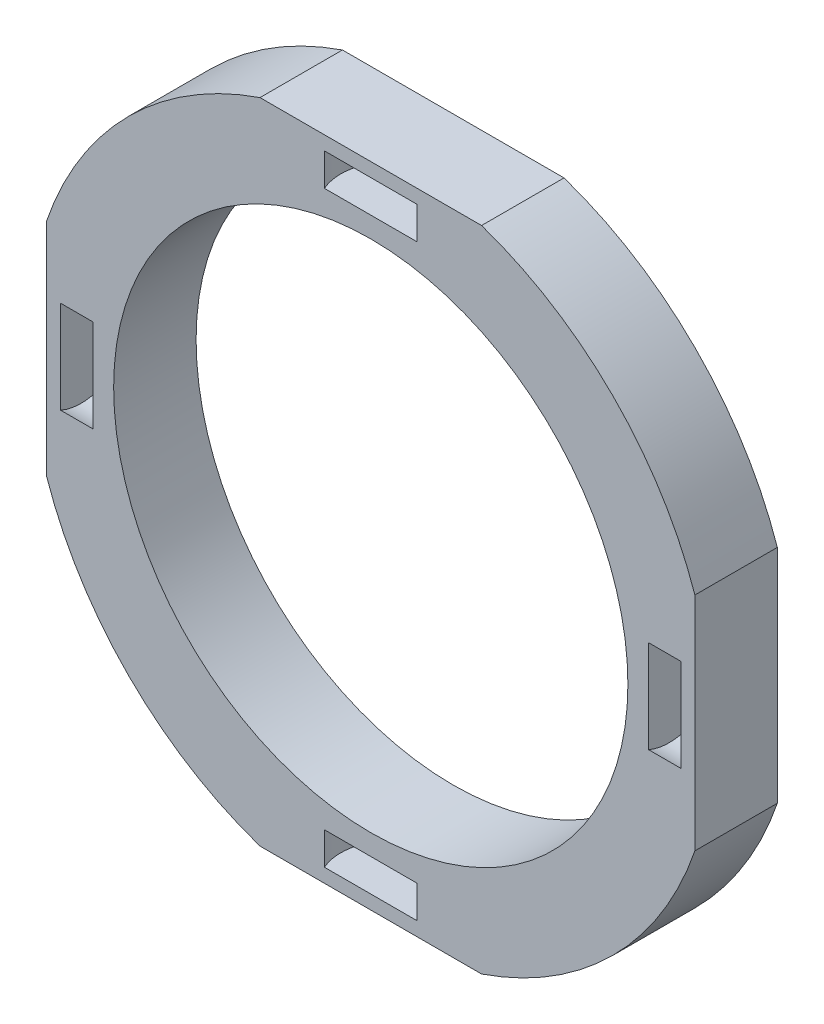
ISO-10303-21;
HEADER;
FILE_DESCRIPTION(('STEP AP214'),'2;1');
FILE_NAME('part.step','',(''),(''),'','','');
FILE_SCHEMA(('AUTOMOTIVE_DESIGN { 1 0 10303 214 1 1 1 1 }'));
ENDSEC;
DATA;
#1=APPLICATION_CONTEXT('core data for automotive mechanical design processes');
#2=APPLICATION_PROTOCOL_DEFINITION('international standard','automotive_design',2000,#1);
#3=PRODUCT_CONTEXT('',#1,'mechanical');
#4=PRODUCT('Part','Part','',(#3));
#5=PRODUCT_RELATED_PRODUCT_CATEGORY('part','',(#4));
#6=PRODUCT_DEFINITION_FORMATION('','',#4);
#7=PRODUCT_DEFINITION_CONTEXT('part definition',#1,'design');
#8=PRODUCT_DEFINITION('design','',#6,#7);
#9=PRODUCT_DEFINITION_SHAPE('','',#8);
#10=(LENGTH_UNIT() NAMED_UNIT(*) SI_UNIT(.MILLI.,.METRE.));
#11=(NAMED_UNIT(*) PLANE_ANGLE_UNIT() SI_UNIT($,.RADIAN.));
#12=(NAMED_UNIT(*) SI_UNIT($,.STERADIAN.) SOLID_ANGLE_UNIT());
#13=UNCERTAINTY_MEASURE_WITH_UNIT(LENGTH_MEASURE(1.E-05),#10,'distance_accuracy_value','');
#14=(GEOMETRIC_REPRESENTATION_CONTEXT(3) GLOBAL_UNCERTAINTY_ASSIGNED_CONTEXT((#13)) GLOBAL_UNIT_ASSIGNED_CONTEXT((#10,
#11,#12)) REPRESENTATION_CONTEXT('',''));
#15=CARTESIAN_POINT('',(0.,0.,0.));
#16=DIRECTION('',(0.,0.,1.));
#17=DIRECTION('',(1.,0.,0.));
#18=AXIS2_PLACEMENT_3D('',#15,#16,#17);
#19=CARTESIAN_POINT('',(0.,0.,1.016));
#20=DIRECTION('',(0.,0.,1.));
#21=DIRECTION('',(1.,0.,0.));
#22=AXIS2_PLACEMENT_3D('',#19,#20,#21);
#23=PLANE('',#22);
#24=DIRECTION('',(0.,1.,0.));
#25=VECTOR('',#24,1.);
#26=CARTESIAN_POINT('',(13.6906,0.,1.016));
#27=LINE('',#26,#25);
#28=CARTESIAN_POINT('',(13.6906,-2.284238114777,1.016));
#29=VERTEX_POINT('',#28);
#30=CARTESIAN_POINT('',(13.6906,2.284238114777,1.016));
#31=VERTEX_POINT('',#30);
#32=EDGE_CURVE('E164',#29,#31,#27,.T.);
#33=ORIENTED_EDGE('',*,*,#32,.T.);
#34=DIRECTION('',(-1.,0.,0.));
#35=VECTOR('',#34,1.);
#36=CARTESIAN_POINT('',(13.6906,2.284238114777,1.016));
#37=LINE('',#36,#35);
#38=CARTESIAN_POINT('',(15.2908,2.284238114777,1.016));
#39=VERTEX_POINT('',#38);
#40=EDGE_CURVE('E161',#31,#39,#37,.F.);
#41=ORIENTED_EDGE('',*,*,#40,.T.);
#42=DIRECTION('',(0.,-1.,0.));
#43=VECTOR('',#42,1.);
#44=CARTESIAN_POINT('',(15.2908,0.,1.016));
#45=LINE('',#44,#43);
#46=CARTESIAN_POINT('',(15.2908,-2.284238114777,1.016));
#47=VERTEX_POINT('',#46);
#48=EDGE_CURVE('E167',#39,#47,#45,.T.);
#49=ORIENTED_EDGE('',*,*,#48,.T.);
#50=DIRECTION('',(-1.,0.,0.));
#51=VECTOR('',#50,1.);
#52=CARTESIAN_POINT('',(13.6906,-2.284238114777,1.016));
#53=LINE('',#52,#51);
#54=EDGE_CURVE('E170',#47,#29,#53,.T.);
#55=ORIENTED_EDGE('',*,*,#54,.T.);
#56=EDGE_LOOP('',(#33,#41,#49,#55));
#57=FACE_BOUND('',#56,.T.);
#58=DIRECTION('',(0.,-1.,0.));
#59=VECTOR('',#58,1.);
#60=CARTESIAN_POINT('',(-13.6906,0.,1.016));
#61=LINE('',#60,#59);
#62=CARTESIAN_POINT('',(-13.6906,2.284238114777,1.016));
#63=VERTEX_POINT('',#62);
#64=CARTESIAN_POINT('',(-13.6906,-2.284238114777,1.016));
#65=VERTEX_POINT('',#64);
#66=EDGE_CURVE('E188',#63,#65,#61,.T.);
#67=ORIENTED_EDGE('',*,*,#66,.T.);
#68=DIRECTION('',(1.,0.,0.));
#69=VECTOR('',#68,1.);
#70=CARTESIAN_POINT('',(-13.6906,-2.284238114777,1.016));
#71=LINE('',#70,#69);
#72=CARTESIAN_POINT('',(-15.2908,-2.284238114777,1.016));
#73=VERTEX_POINT('',#72);
#74=EDGE_CURVE('E185',#65,#73,#71,.F.);
#75=ORIENTED_EDGE('',*,*,#74,.T.);
#76=DIRECTION('',(0.,1.,0.));
#77=VECTOR('',#76,1.);
#78=CARTESIAN_POINT('',(-15.2908,0.,1.016));
#79=LINE('',#78,#77);
#80=CARTESIAN_POINT('',(-15.2908,2.284238114777,1.016));
#81=VERTEX_POINT('',#80);
#82=EDGE_CURVE('E191',#73,#81,#79,.T.);
#83=ORIENTED_EDGE('',*,*,#82,.T.);
#84=DIRECTION('',(1.,0.,0.));
#85=VECTOR('',#84,1.);
#86=CARTESIAN_POINT('',(-13.6906,2.284238114777,1.016));
#87=LINE('',#86,#85);
#88=EDGE_CURVE('E194',#81,#63,#87,.T.);
#89=ORIENTED_EDGE('',*,*,#88,.T.);
#90=EDGE_LOOP('',(#67,#75,#83,#89));
#91=FACE_BOUND('',#90,.T.);
#92=CARTESIAN_POINT('',(0.,0.,1.016));
#93=DIRECTION('',(0.,0.,1.));
#94=DIRECTION('',(1.,0.,0.));
#95=AXIS2_PLACEMENT_3D('',#92,#93,#94);
#96=CIRCLE('',#95,12.6746);
#97=CARTESIAN_POINT('',(12.6746,0.,1.016));
#98=VERTEX_POINT('',#97);
#99=EDGE_CURVE('E252',#98,#98,#96,.T.);
#100=ORIENTED_EDGE('',*,*,#99,.F.);
#101=EDGE_LOOP('',(#100));
#102=FACE_BOUND('',#101,.T.);
#103=DIRECTION('',(0.,1.,0.));
#104=VECTOR('',#103,1.);
#105=CARTESIAN_POINT('',(15.9766,0.,1.016));
#106=LINE('',#105,#104);
#107=CARTESIAN_POINT('',(15.9766,-5.46108821676877,1.016));
#108=VERTEX_POINT('',#107);
#109=CARTESIAN_POINT('',(15.9766,5.46108821676877,1.016));
#110=VERTEX_POINT('',#109);
#111=EDGE_CURVE('E249',#108,#110,#106,.T.);
#112=ORIENTED_EDGE('',*,*,#111,.T.);
#113=CARTESIAN_POINT('',(0.,0.,1.016));
#114=DIRECTION('',(0.,0.,1.));
#115=DIRECTION('',(1.,0.,0.));
#116=AXIS2_PLACEMENT_3D('',#113,#114,#115);
#117=CIRCLE('',#116,16.8841710507603);
#118=CARTESIAN_POINT('',(5.46108821676877,15.9766,1.016));
#119=VERTEX_POINT('',#118);
#120=EDGE_CURVE('E246',#110,#119,#117,.T.);
#121=ORIENTED_EDGE('',*,*,#120,.T.);
#122=DIRECTION('',(-1.,0.,0.));
#123=VECTOR('',#122,1.);
#124=CARTESIAN_POINT('',(0.,15.9766,1.016));
#125=LINE('',#124,#123);
#126=CARTESIAN_POINT('',(-5.46108821676877,15.9766,1.016));
#127=VERTEX_POINT('',#126);
#128=EDGE_CURVE('E243',#119,#127,#125,.T.);
#129=ORIENTED_EDGE('',*,*,#128,.T.);
#130=CARTESIAN_POINT('',(-15.9766,5.46108821676877,1.016));
#131=VERTEX_POINT('',#130);
#132=EDGE_CURVE('E242',#127,#131,#117,.T.);
#133=ORIENTED_EDGE('',*,*,#132,.T.);
#134=DIRECTION('',(0.,-1.,0.));
#135=VECTOR('',#134,1.);
#136=CARTESIAN_POINT('',(-15.9766,0.,1.016));
#137=LINE('',#136,#135);
#138=CARTESIAN_POINT('',(-15.9766,-5.46108821676877,1.016));
#139=VERTEX_POINT('',#138);
#140=EDGE_CURVE('E239',#131,#139,#137,.T.);
#141=ORIENTED_EDGE('',*,*,#140,.T.);
#142=CARTESIAN_POINT('',(-5.46108821676877,-15.9766,1.016));
#143=VERTEX_POINT('',#142);
#144=EDGE_CURVE('E238',#139,#143,#117,.T.);
#145=ORIENTED_EDGE('',*,*,#144,.T.);
#146=DIRECTION('',(1.,0.,0.));
#147=VECTOR('',#146,1.);
#148=CARTESIAN_POINT('',(0.,-15.9766,1.016));
#149=LINE('',#148,#147);
#150=CARTESIAN_POINT('',(5.46108821676877,-15.9766,1.016));
#151=VERTEX_POINT('',#150);
#152=EDGE_CURVE('E235',#143,#151,#149,.T.);
#153=ORIENTED_EDGE('',*,*,#152,.T.);
#154=EDGE_CURVE('E234',#151,#108,#117,.T.);
#155=ORIENTED_EDGE('',*,*,#154,.T.);
#156=EDGE_LOOP('',(#112,#121,#129,#133,#141,#145,#153,#155));
#157=FACE_BOUND('',#156,.T.);
#158=DIRECTION('',(1.,0.,0.));
#159=VECTOR('',#158,1.);
#160=CARTESIAN_POINT('',(0.,-13.6906,1.016));
#161=LINE('',#160,#159);
#162=CARTESIAN_POINT('',(-2.28423811477695,-13.6906,1.016));
#163=VERTEX_POINT('',#162);
#164=CARTESIAN_POINT('',(2.28423811477705,-13.6906,1.016));
#165=VERTEX_POINT('',#164);
#166=EDGE_CURVE('E176',#163,#165,#161,.T.);
#167=ORIENTED_EDGE('',*,*,#166,.T.);
#168=DIRECTION('',(0.,1.,0.));
#169=VECTOR('',#168,1.);
#170=CARTESIAN_POINT('',(2.28423811477705,-13.6906,1.016));
#171=LINE('',#170,#169);
#172=CARTESIAN_POINT('',(2.28423811477706,-15.2908,1.016));
#173=VERTEX_POINT('',#172);
#174=EDGE_CURVE('E173',#165,#173,#171,.F.);
#175=ORIENTED_EDGE('',*,*,#174,.T.);
#176=DIRECTION('',(-1.,0.,0.));
#177=VECTOR('',#176,1.);
#178=CARTESIAN_POINT('',(0.,-15.2908,1.016));
#179=LINE('',#178,#177);
#180=CARTESIAN_POINT('',(-2.28423811477695,-15.2908,1.016));
#181=VERTEX_POINT('',#180);
#182=EDGE_CURVE('E179',#173,#181,#179,.T.);
#183=ORIENTED_EDGE('',*,*,#182,.T.);
#184=DIRECTION('',(0.,1.,0.));
#185=VECTOR('',#184,1.);
#186=CARTESIAN_POINT('',(-2.28423811477695,-13.6906,1.016));
#187=LINE('',#186,#185);
#188=EDGE_CURVE('E182',#181,#163,#187,.T.);
#189=ORIENTED_EDGE('',*,*,#188,.T.);
#190=EDGE_LOOP('',(#167,#175,#183,#189));
#191=FACE_BOUND('',#190,.T.);
#192=DIRECTION('',(-1.,0.,0.));
#193=VECTOR('',#192,1.);
#194=CARTESIAN_POINT('',(-1.45078038199538E-13,13.6906,1.016));
#195=LINE('',#194,#193);
#196=CARTESIAN_POINT('',(2.28423811477686,13.6906,1.016));
#197=VERTEX_POINT('',#196);
#198=CARTESIAN_POINT('',(-2.28423811477715,13.6906,1.016));
#199=VERTEX_POINT('',#198);
#200=EDGE_CURVE('E43',#197,#199,#195,.T.);
#201=ORIENTED_EDGE('',*,*,#200,.T.);
#202=DIRECTION('',(0.,-1.,0.));
#203=VECTOR('',#202,1.);
#204=CARTESIAN_POINT('',(-2.28423811477714,13.6906,1.016));
#205=LINE('',#204,#203);
#206=CARTESIAN_POINT('',(-2.28423811477716,15.2908,1.016));
#207=VERTEX_POINT('',#206);
#208=EDGE_CURVE('E11',#199,#207,#205,.F.);
#209=ORIENTED_EDGE('',*,*,#208,.T.);
#210=DIRECTION('',(1.,0.,0.));
#211=VECTOR('',#210,1.);
#212=CARTESIAN_POINT('',(-1.62035211495588E-13,15.2908,1.016));
#213=LINE('',#212,#211);
#214=CARTESIAN_POINT('',(2.28423811477684,15.2908,1.016));
#215=VERTEX_POINT('',#214);
#216=EDGE_CURVE('E157',#207,#215,#213,.T.);
#217=ORIENTED_EDGE('',*,*,#216,.T.);
#218=DIRECTION('',(0.,-1.,0.));
#219=VECTOR('',#218,1.);
#220=CARTESIAN_POINT('',(2.28423811477686,13.6906,1.016));
#221=LINE('',#220,#219);
#222=EDGE_CURVE('E156',#215,#197,#221,.T.);
#223=ORIENTED_EDGE('',*,*,#222,.T.);
#224=EDGE_LOOP('',(#201,#209,#217,#223));
#225=FACE_BOUND('',#224,.T.);
#226=ADVANCED_FACE('F35',(#57,#91,#102,#157,#191,#225),#23,.T.);
#227=CARTESIAN_POINT('',(15.9766,0.,-3.048));
#228=DIRECTION('',(1.,0.,0.));
#229=DIRECTION('',(0.,0.,-1.));
#230=AXIS2_PLACEMENT_3D('',#227,#228,#229);
#231=PLANE('',#230);
#232=DIRECTION('',(0.,0.,1.));
#233=VECTOR('',#232,1.);
#234=CARTESIAN_POINT('',(15.9766,5.46108821676877,-3.048));
#235=LINE('',#234,#233);
#236=CARTESIAN_POINT('',(15.9766,5.46108821676877,-3.048));
#237=VERTEX_POINT('',#236);
#238=EDGE_CURVE('E198',#237,#110,#235,.T.);
#239=ORIENTED_EDGE('',*,*,#238,.T.);
#240=ORIENTED_EDGE('',*,*,#111,.F.);
#241=DIRECTION('',(0.,0.,1.));
#242=VECTOR('',#241,1.);
#243=CARTESIAN_POINT('',(15.9766,-5.46108821676877,-3.048));
#244=LINE('',#243,#242);
#245=CARTESIAN_POINT('',(15.9766,-5.46108821676877,-3.048));
#246=VERTEX_POINT('',#245);
#247=EDGE_CURVE('E197',#246,#108,#244,.T.);
#248=ORIENTED_EDGE('',*,*,#247,.F.);
#249=DIRECTION('',(0.,1.,0.));
#250=VECTOR('',#249,1.);
#251=CARTESIAN_POINT('',(15.9766,0.,-3.048));
#252=LINE('',#251,#250);
#253=EDGE_CURVE('E228',#246,#237,#252,.T.);
#254=ORIENTED_EDGE('',*,*,#253,.T.);
#255=EDGE_LOOP('',(#239,#240,#248,#254));
#256=FACE_BOUND('',#255,.T.);
#257=ADVANCED_FACE('F281',(#256),#231,.T.);
#258=CARTESIAN_POINT('',(0.,0.,-3.048));
#259=DIRECTION('',(0.,0.,1.));
#260=DIRECTION('',(1.,0.,0.));
#261=AXIS2_PLACEMENT_3D('',#258,#259,#260);
#262=CYLINDRICAL_SURFACE('',#261,16.8841710507603);
#263=ORIENTED_EDGE('',*,*,#247,.T.);
#264=ORIENTED_EDGE('',*,*,#154,.F.);
#265=DIRECTION('',(0.,0.,1.));
#266=VECTOR('',#265,1.);
#267=CARTESIAN_POINT('',(5.46108821676877,-15.9766,-3.048));
#268=LINE('',#267,#266);
#269=CARTESIAN_POINT('',(5.46108821676877,-15.9766,-3.048));
#270=VERTEX_POINT('',#269);
#271=EDGE_CURVE('E211',#270,#151,#268,.T.);
#272=ORIENTED_EDGE('',*,*,#271,.F.);
#273=CARTESIAN_POINT('',(0.,0.,-3.048));
#274=DIRECTION('',(0.,0.,1.));
#275=DIRECTION('',(1.,0.,0.));
#276=AXIS2_PLACEMENT_3D('',#273,#274,#275);
#277=CIRCLE('',#276,16.8841710507603);
#278=EDGE_CURVE('E201',#270,#246,#277,.T.);
#279=ORIENTED_EDGE('',*,*,#278,.T.);
#280=EDGE_LOOP('',(#263,#264,#272,#279));
#281=FACE_BOUND('',#280,.T.);
#282=ADVANCED_FACE('F287',(#281),#262,.T.);
#283=CARTESIAN_POINT('',(0.,-15.9766,-3.048));
#284=DIRECTION('',(0.,-1.,0.));
#285=DIRECTION('',(0.,0.,-1.));
#286=AXIS2_PLACEMENT_3D('',#283,#284,#285);
#287=PLANE('',#286);
#288=ORIENTED_EDGE('',*,*,#271,.T.);
#289=ORIENTED_EDGE('',*,*,#152,.F.);
#290=DIRECTION('',(0.,0.,1.));
#291=VECTOR('',#290,1.);
#292=CARTESIAN_POINT('',(-5.46108821676877,-15.9766,-3.048));
#293=LINE('',#292,#291);
#294=CARTESIAN_POINT('',(-5.46108821676877,-15.9766,-3.048));
#295=VERTEX_POINT('',#294);
#296=EDGE_CURVE('E209',#295,#143,#293,.T.);
#297=ORIENTED_EDGE('',*,*,#296,.F.);
#298=DIRECTION('',(1.,0.,0.));
#299=VECTOR('',#298,1.);
#300=CARTESIAN_POINT('',(0.,-15.9766,-3.048));
#301=LINE('',#300,#299);
#302=EDGE_CURVE('E214',#295,#270,#301,.T.);
#303=ORIENTED_EDGE('',*,*,#302,.T.);
#304=EDGE_LOOP('',(#288,#289,#297,#303));
#305=FACE_BOUND('',#304,.T.);
#306=ADVANCED_FACE('F301',(#305),#287,.T.);
#307=ORIENTED_EDGE('',*,*,#296,.T.);
#308=ORIENTED_EDGE('',*,*,#144,.F.);
#309=DIRECTION('',(0.,0.,1.));
#310=VECTOR('',#309,1.);
#311=CARTESIAN_POINT('',(-15.9766,-5.46108821676877,-3.048));
#312=LINE('',#311,#310);
#313=CARTESIAN_POINT('',(-15.9766,-5.46108821676877,-3.048));
#314=VERTEX_POINT('',#313);
#315=EDGE_CURVE('E207',#314,#139,#312,.T.);
#316=ORIENTED_EDGE('',*,*,#315,.F.);
#317=EDGE_CURVE('E217',#314,#295,#277,.T.);
#318=ORIENTED_EDGE('',*,*,#317,.T.);
#319=EDGE_LOOP('',(#307,#308,#316,#318));
#320=FACE_BOUND('',#319,.T.);
#321=ADVANCED_FACE('F303',(#320),#262,.T.);
#322=CARTESIAN_POINT('',(-15.9766,0.,-3.048));
#323=DIRECTION('',(-1.,0.,0.));
#324=DIRECTION('',(0.,0.,1.));
#325=AXIS2_PLACEMENT_3D('',#322,#323,#324);
#326=PLANE('',#325);
#327=ORIENTED_EDGE('',*,*,#315,.T.);
#328=ORIENTED_EDGE('',*,*,#140,.F.);
#329=DIRECTION('',(0.,0.,1.));
#330=VECTOR('',#329,1.);
#331=CARTESIAN_POINT('',(-15.9766,5.46108821676877,-3.048));
#332=LINE('',#331,#330);
#333=CARTESIAN_POINT('',(-15.9766,5.46108821676877,-3.048));
#334=VERTEX_POINT('',#333);
#335=EDGE_CURVE('E205',#334,#131,#332,.T.);
#336=ORIENTED_EDGE('',*,*,#335,.F.);
#337=DIRECTION('',(0.,-1.,0.));
#338=VECTOR('',#337,1.);
#339=CARTESIAN_POINT('',(-15.9766,0.,-3.048));
#340=LINE('',#339,#338);
#341=EDGE_CURVE('E218',#334,#314,#340,.T.);
#342=ORIENTED_EDGE('',*,*,#341,.T.);
#343=EDGE_LOOP('',(#327,#328,#336,#342));
#344=FACE_BOUND('',#343,.T.);
#345=ADVANCED_FACE('F307',(#344),#326,.T.);
#346=ORIENTED_EDGE('',*,*,#335,.T.);
#347=ORIENTED_EDGE('',*,*,#132,.F.);
#348=DIRECTION('',(0.,0.,1.));
#349=VECTOR('',#348,1.);
#350=CARTESIAN_POINT('',(-5.46108821676877,15.9766,-3.048));
#351=LINE('',#350,#349);
#352=CARTESIAN_POINT('',(-5.46108821676877,15.9766,-3.048));
#353=VERTEX_POINT('',#352);
#354=EDGE_CURVE('E203',#353,#127,#351,.T.);
#355=ORIENTED_EDGE('',*,*,#354,.F.);
#356=EDGE_CURVE('E221',#353,#334,#277,.T.);
#357=ORIENTED_EDGE('',*,*,#356,.T.);
#358=EDGE_LOOP('',(#346,#347,#355,#357));
#359=FACE_BOUND('',#358,.T.);
#360=ADVANCED_FACE('F310',(#359),#262,.T.);
#361=CARTESIAN_POINT('',(0.,15.9766,-3.048));
#362=DIRECTION('',(0.,1.,0.));
#363=DIRECTION('',(0.,0.,1.));
#364=AXIS2_PLACEMENT_3D('',#361,#362,#363);
#365=PLANE('',#364);
#366=ORIENTED_EDGE('',*,*,#354,.T.);
#367=ORIENTED_EDGE('',*,*,#128,.F.);
#368=DIRECTION('',(0.,0.,1.));
#369=VECTOR('',#368,1.);
#370=CARTESIAN_POINT('',(5.46108821676877,15.9766,-3.048));
#371=LINE('',#370,#369);
#372=CARTESIAN_POINT('',(5.46108821676877,15.9766,-3.048));
#373=VERTEX_POINT('',#372);
#374=EDGE_CURVE('E200',#373,#119,#371,.T.);
#375=ORIENTED_EDGE('',*,*,#374,.F.);
#376=DIRECTION('',(-1.,0.,0.));
#377=VECTOR('',#376,1.);
#378=CARTESIAN_POINT('',(0.,15.9766,-3.048));
#379=LINE('',#378,#377);
#380=EDGE_CURVE('E222',#373,#353,#379,.T.);
#381=ORIENTED_EDGE('',*,*,#380,.T.);
#382=EDGE_LOOP('',(#366,#367,#375,#381));
#383=FACE_BOUND('',#382,.T.);
#384=ADVANCED_FACE('F312',(#383),#365,.T.);
#385=CARTESIAN_POINT('',(0.,0.,-3.048));
#386=DIRECTION('',(0.,0.,1.));
#387=DIRECTION('',(1.,0.,0.));
#388=AXIS2_PLACEMENT_3D('',#385,#386,#387);
#389=CYLINDRICAL_SURFACE('',#388,12.6746);
#390=CARTESIAN_POINT('',(0.,0.,-3.048));
#391=DIRECTION('',(0.,0.,1.));
#392=DIRECTION('',(1.,0.,0.));
#393=AXIS2_PLACEMENT_3D('',#390,#391,#392);
#394=CIRCLE('',#393,12.6746);
#395=CARTESIAN_POINT('',(12.6746,0.,-3.048));
#396=VERTEX_POINT('',#395);
#397=EDGE_CURVE('E231',#396,#396,#394,.T.);
#398=ORIENTED_EDGE('',*,*,#397,.F.);
#399=EDGE_LOOP('',(#398));
#400=FACE_BOUND('',#399,.T.);
#401=ORIENTED_EDGE('',*,*,#99,.T.);
#402=EDGE_LOOP('',(#401));
#403=FACE_BOUND('',#402,.T.);
#404=ADVANCED_FACE('F37',(#400,#403),#389,.F.);
#405=ORIENTED_EDGE('',*,*,#374,.T.);
#406=ORIENTED_EDGE('',*,*,#120,.F.);
#407=ORIENTED_EDGE('',*,*,#238,.F.);
#408=EDGE_CURVE('E225',#237,#373,#277,.T.);
#409=ORIENTED_EDGE('',*,*,#408,.T.);
#410=EDGE_LOOP('',(#405,#406,#407,#409));
#411=FACE_BOUND('',#410,.T.);
#412=ADVANCED_FACE('F297',(#411),#262,.T.);
#413=CARTESIAN_POINT('',(0.,0.,-3.048));
#414=DIRECTION('',(0.,0.,1.));
#415=DIRECTION('',(1.,0.,0.));
#416=AXIS2_PLACEMENT_3D('',#413,#414,#415);
#417=PLANE('',#416);
#418=ORIENTED_EDGE('',*,*,#397,.T.);
#419=EDGE_LOOP('',(#418));
#420=FACE_BOUND('',#419,.T.);
#421=ORIENTED_EDGE('',*,*,#253,.F.);
#422=ORIENTED_EDGE('',*,*,#278,.F.);
#423=ORIENTED_EDGE('',*,*,#302,.F.);
#424=ORIENTED_EDGE('',*,*,#317,.F.);
#425=ORIENTED_EDGE('',*,*,#341,.F.);
#426=ORIENTED_EDGE('',*,*,#356,.F.);
#427=ORIENTED_EDGE('',*,*,#380,.F.);
#428=ORIENTED_EDGE('',*,*,#408,.F.);
#429=EDGE_LOOP('',(#421,#422,#423,#424,#425,#426,#427,#428));
#430=FACE_BOUND('',#429,.T.);
#431=ADVANCED_FACE('F294',(#420,#430),#417,.F.);
#432=CARTESIAN_POINT('',(-13.6906,-2.499999953,0.));
#433=DIRECTION('',(-1.,0.,0.));
#434=DIRECTION('',(0.,-1.,0.));
#435=AXIS2_PLACEMENT_3D('',#432,#433,#434);
#436=PLANE('',#435);
#437=CARTESIAN_POINT('',(-13.6906,0.,0.));
#438=DIRECTION('',(1.,0.,0.));
#439=DIRECTION('',(0.,1.,0.));
#440=AXIS2_PLACEMENT_3D('',#437,#438,#439);
#441=CIRCLE('',#440,2.499999953);
#442=EDGE_CURVE('E258',#65,#63,#441,.T.);
#443=ORIENTED_EDGE('',*,*,#442,.F.);
#444=ORIENTED_EDGE('',*,*,#66,.F.);
#445=EDGE_LOOP('',(#443,#444));
#446=FACE_BOUND('',#445,.T.);
#447=ADVANCED_FACE('F292',(#446),#436,.T.);
#448=CARTESIAN_POINT('',(-15.2908,-2.499999953,0.));
#449=DIRECTION('',(1.,0.,0.));
#450=DIRECTION('',(0.,1.,0.));
#451=AXIS2_PLACEMENT_3D('',#448,#449,#450);
#452=PLANE('',#451);
#453=CARTESIAN_POINT('',(-15.2908,0.,0.));
#454=DIRECTION('',(1.,0.,0.));
#455=DIRECTION('',(0.,1.,0.));
#456=AXIS2_PLACEMENT_3D('',#453,#454,#455);
#457=CIRCLE('',#456,2.499999953);
#458=EDGE_CURVE('E255',#73,#81,#457,.T.);
#459=ORIENTED_EDGE('',*,*,#458,.T.);
#460=ORIENTED_EDGE('',*,*,#82,.F.);
#461=EDGE_LOOP('',(#459,#460));
#462=FACE_BOUND('',#461,.T.);
#463=ADVANCED_FACE('F393',(#462),#452,.T.);
#464=CARTESIAN_POINT('',(-13.6906,0.,0.));
#465=DIRECTION('',(1.,0.,0.));
#466=DIRECTION('',(0.,1.,0.));
#467=AXIS2_PLACEMENT_3D('',#464,#465,#466);
#468=CYLINDRICAL_SURFACE('',#467,2.499999953);
#469=ORIENTED_EDGE('',*,*,#442,.T.);
#470=ORIENTED_EDGE('',*,*,#88,.F.);
#471=ORIENTED_EDGE('',*,*,#458,.F.);
#472=ORIENTED_EDGE('',*,*,#74,.F.);
#473=EDGE_LOOP('',(#469,#470,#471,#472));
#474=FACE_BOUND('',#473,.T.);
#475=ADVANCED_FACE('F402',(#474),#468,.F.);
#476=CARTESIAN_POINT('',(2.49999995300005,-13.6906,0.));
#477=DIRECTION('',(0.,-1.,0.));
#478=DIRECTION('',(1.,0.,0.));
#479=AXIS2_PLACEMENT_3D('',#476,#477,#478);
#480=PLANE('',#479);
#481=CARTESIAN_POINT('',(0.,-13.6906,0.));
#482=DIRECTION('',(0.,1.,0.));
#483=DIRECTION('',(-1.,0.,0.));
#484=AXIS2_PLACEMENT_3D('',#481,#482,#483);
#485=CIRCLE('',#484,2.499999953);
#486=EDGE_CURVE('E263',#165,#163,#485,.T.);
#487=ORIENTED_EDGE('',*,*,#486,.F.);
#488=ORIENTED_EDGE('',*,*,#166,.F.);
#489=EDGE_LOOP('',(#487,#488));
#490=FACE_BOUND('',#489,.T.);
#491=ADVANCED_FACE('F410',(#490),#480,.T.);
#492=CARTESIAN_POINT('',(2.49999995300005,-15.2908,0.));
#493=DIRECTION('',(0.,1.,0.));
#494=DIRECTION('',(-1.,0.,0.));
#495=AXIS2_PLACEMENT_3D('',#492,#493,#494);
#496=PLANE('',#495);
#497=CARTESIAN_POINT('',(0.,-15.2908,0.));
#498=DIRECTION('',(0.,1.,0.));
#499=DIRECTION('',(-1.,0.,0.));
#500=AXIS2_PLACEMENT_3D('',#497,#498,#499);
#501=CIRCLE('',#500,2.499999953);
#502=EDGE_CURVE('E260',#173,#181,#501,.T.);
#503=ORIENTED_EDGE('',*,*,#502,.T.);
#504=ORIENTED_EDGE('',*,*,#182,.F.);
#505=EDGE_LOOP('',(#503,#504));
#506=FACE_BOUND('',#505,.T.);
#507=ADVANCED_FACE('F425',(#506),#496,.T.);
#508=CARTESIAN_POINT('',(0.,-13.6906,0.));
#509=DIRECTION('',(0.,1.,0.));
#510=DIRECTION('',(-1.,0.,0.));
#511=AXIS2_PLACEMENT_3D('',#508,#509,#510);
#512=CYLINDRICAL_SURFACE('',#511,2.499999953);
#513=ORIENTED_EDGE('',*,*,#486,.T.);
#514=ORIENTED_EDGE('',*,*,#188,.F.);
#515=ORIENTED_EDGE('',*,*,#502,.F.);
#516=ORIENTED_EDGE('',*,*,#174,.F.);
#517=EDGE_LOOP('',(#513,#514,#515,#516));
#518=FACE_BOUND('',#517,.T.);
#519=ADVANCED_FACE('F435',(#518),#512,.F.);
#520=CARTESIAN_POINT('',(13.6906,2.499999953,0.));
#521=DIRECTION('',(1.,0.,0.));
#522=DIRECTION('',(0.,1.,0.));
#523=AXIS2_PLACEMENT_3D('',#520,#521,#522);
#524=PLANE('',#523);
#525=CARTESIAN_POINT('',(13.6906,0.,0.));
#526=DIRECTION('',(-1.,0.,0.));
#527=DIRECTION('',(0.,-1.,0.));
#528=AXIS2_PLACEMENT_3D('',#525,#526,#527);
#529=CIRCLE('',#528,2.499999953);
#530=EDGE_CURVE('E58',#31,#29,#529,.T.);
#531=ORIENTED_EDGE('',*,*,#530,.F.);
#532=ORIENTED_EDGE('',*,*,#32,.F.);
#533=EDGE_LOOP('',(#531,#532));
#534=FACE_BOUND('',#533,.T.);
#535=ADVANCED_FACE('F445',(#534),#524,.T.);
#536=CARTESIAN_POINT('',(15.2908,2.499999953,0.));
#537=DIRECTION('',(-1.,0.,0.));
#538=DIRECTION('',(0.,-1.,0.));
#539=AXIS2_PLACEMENT_3D('',#536,#537,#538);
#540=PLANE('',#539);
#541=CARTESIAN_POINT('',(15.2908,0.,0.));
#542=DIRECTION('',(-1.,0.,0.));
#543=DIRECTION('',(0.,-1.,0.));
#544=AXIS2_PLACEMENT_3D('',#541,#542,#543);
#545=CIRCLE('',#544,2.499999953);
#546=EDGE_CURVE('E265',#39,#47,#545,.T.);
#547=ORIENTED_EDGE('',*,*,#546,.T.);
#548=ORIENTED_EDGE('',*,*,#48,.F.);
#549=EDGE_LOOP('',(#547,#548));
#550=FACE_BOUND('',#549,.T.);
#551=ADVANCED_FACE('F455',(#550),#540,.T.);
#552=CARTESIAN_POINT('',(13.6906,0.,0.));
#553=DIRECTION('',(-1.,0.,0.));
#554=DIRECTION('',(0.,-1.,0.));
#555=AXIS2_PLACEMENT_3D('',#552,#553,#554);
#556=CYLINDRICAL_SURFACE('',#555,2.499999953);
#557=ORIENTED_EDGE('',*,*,#530,.T.);
#558=ORIENTED_EDGE('',*,*,#54,.F.);
#559=ORIENTED_EDGE('',*,*,#546,.F.);
#560=ORIENTED_EDGE('',*,*,#40,.F.);
#561=EDGE_LOOP('',(#557,#558,#559,#560));
#562=FACE_BOUND('',#561,.T.);
#563=ADVANCED_FACE('F278',(#562),#556,.F.);
#564=CARTESIAN_POINT('',(-2.49999995300014,13.6906,0.));
#565=DIRECTION('',(0.,1.,0.));
#566=DIRECTION('',(-1.,0.,0.));
#567=AXIS2_PLACEMENT_3D('',#564,#565,#566);
#568=PLANE('',#567);
#569=CARTESIAN_POINT('',(-1.43398312649828E-13,13.6906,0.));
#570=DIRECTION('',(0.,-1.,0.));
#571=DIRECTION('',(1.,0.,0.));
#572=AXIS2_PLACEMENT_3D('',#569,#570,#571);
#573=CIRCLE('',#572,2.499999953);
#574=EDGE_CURVE('E50',#199,#197,#573,.T.);
#575=ORIENTED_EDGE('',*,*,#574,.F.);
#576=ORIENTED_EDGE('',*,*,#200,.F.);
#577=EDGE_LOOP('',(#575,#576));
#578=FACE_BOUND('',#577,.T.);
#579=ADVANCED_FACE('F153',(#578),#568,.T.);
#580=CARTESIAN_POINT('',(-2.49999995300016,15.2908,0.));
#581=DIRECTION('',(0.,-1.,0.));
#582=DIRECTION('',(1.,0.,0.));
#583=AXIS2_PLACEMENT_3D('',#580,#581,#582);
#584=PLANE('',#583);
#585=CARTESIAN_POINT('',(-1.60355485945877E-13,15.2908,0.));
#586=DIRECTION('',(0.,-1.,0.));
#587=DIRECTION('',(1.,0.,0.));
#588=AXIS2_PLACEMENT_3D('',#585,#586,#587);
#589=CIRCLE('',#588,2.499999953);
#590=EDGE_CURVE('E148',#207,#215,#589,.T.);
#591=ORIENTED_EDGE('',*,*,#590,.T.);
#592=ORIENTED_EDGE('',*,*,#216,.F.);
#593=EDGE_LOOP('',(#591,#592));
#594=FACE_BOUND('',#593,.T.);
#595=ADVANCED_FACE('F270',(#594),#584,.T.);
#596=CARTESIAN_POINT('',(-1.43398312649828E-13,13.6906,0.));
#597=DIRECTION('',(0.,-1.,0.));
#598=DIRECTION('',(1.,0.,0.));
#599=AXIS2_PLACEMENT_3D('',#596,#597,#598);
#600=CYLINDRICAL_SURFACE('',#599,2.499999953);
#601=ORIENTED_EDGE('',*,*,#574,.T.);
#602=ORIENTED_EDGE('',*,*,#222,.F.);
#603=ORIENTED_EDGE('',*,*,#590,.F.);
#604=ORIENTED_EDGE('',*,*,#208,.F.);
#605=EDGE_LOOP('',(#601,#602,#603,#604));
#606=FACE_BOUND('',#605,.T.);
#607=ADVANCED_FACE('F146',(#606),#600,.F.);
#608=CLOSED_SHELL('',(#226,#257,#282,#306,#321,#345,#360,#384,#404,#412,#431,#447,#463,#475,
#491,#507,#519,#535,#551,#563,#579,#595,#607));
#609=MANIFOLD_SOLID_BREP('B2',#608);
#610=ADVANCED_BREP_SHAPE_REPRESENTATION('',(#18,#609),#14);
#611=SHAPE_DEFINITION_REPRESENTATION(#9,#610);
ENDSEC;
END-ISO-10303-21;
